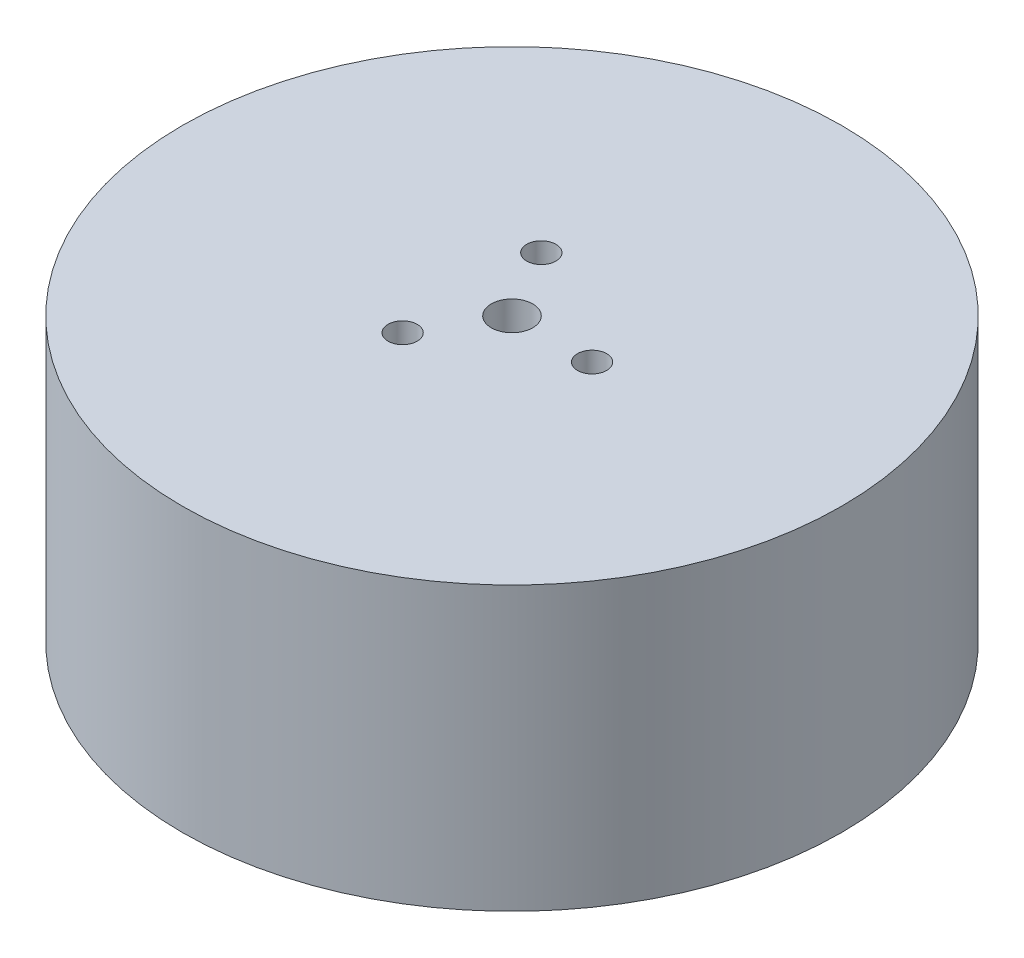
ISO-10303-21;
HEADER;
FILE_DESCRIPTION(('STEP AP214'),'2;1');
FILE_NAME('part.step','',(''),(''),'','','');
FILE_SCHEMA(('AUTOMOTIVE_DESIGN { 1 0 10303 214 1 1 1 1 }'));
ENDSEC;
DATA;
#1=APPLICATION_CONTEXT('core data for automotive mechanical design processes');
#2=APPLICATION_PROTOCOL_DEFINITION('international standard','automotive_design',2000,#1);
#3=PRODUCT_CONTEXT('',#1,'mechanical');
#4=PRODUCT('Part','Part','',(#3));
#5=PRODUCT_RELATED_PRODUCT_CATEGORY('part','',(#4));
#6=PRODUCT_DEFINITION_FORMATION('','',#4);
#7=PRODUCT_DEFINITION_CONTEXT('part definition',#1,'design');
#8=PRODUCT_DEFINITION('design','',#6,#7);
#9=PRODUCT_DEFINITION_SHAPE('','',#8);
#10=(LENGTH_UNIT() NAMED_UNIT(*) SI_UNIT(.MILLI.,.METRE.));
#11=(NAMED_UNIT(*) PLANE_ANGLE_UNIT() SI_UNIT($,.RADIAN.));
#12=(NAMED_UNIT(*) SI_UNIT($,.STERADIAN.) SOLID_ANGLE_UNIT());
#13=UNCERTAINTY_MEASURE_WITH_UNIT(LENGTH_MEASURE(1.E-05),#10,'distance_accuracy_value','');
#14=(GEOMETRIC_REPRESENTATION_CONTEXT(3) GLOBAL_UNCERTAINTY_ASSIGNED_CONTEXT((#13)) GLOBAL_UNIT_ASSIGNED_CONTEXT((#10,
#11,#12)) REPRESENTATION_CONTEXT('',''));
#15=CARTESIAN_POINT('',(0.,0.,0.));
#16=DIRECTION('',(0.,0.,1.));
#17=DIRECTION('',(1.,0.,0.));
#18=AXIS2_PLACEMENT_3D('',#15,#16,#17);
#19=CARTESIAN_POINT('',(0.,30.,0.));
#20=DIRECTION('',(0.,-1.,0.));
#21=DIRECTION('',(0.,0.,-1.));
#22=AXIS2_PLACEMENT_3D('',#19,#20,#21);
#23=CYLINDRICAL_SURFACE('',#22,35.);
#24=CARTESIAN_POINT('',(0.,30.,0.));
#25=DIRECTION('',(0.,1.,0.));
#26=DIRECTION('',(0.,0.,1.));
#27=AXIS2_PLACEMENT_3D('',#24,#25,#26);
#28=CIRCLE('',#27,35.);
#29=CARTESIAN_POINT('',(0.,30.,35.));
#30=VERTEX_POINT('',#29);
#31=EDGE_CURVE('E10',#30,#30,#28,.T.);
#32=ORIENTED_EDGE('',*,*,#31,.F.);
#33=EDGE_LOOP('',(#32));
#34=FACE_BOUND('',#33,.T.);
#35=CARTESIAN_POINT('',(0.,0.,0.));
#36=DIRECTION('',(0.,1.,0.));
#37=DIRECTION('',(0.,0.,1.));
#38=AXIS2_PLACEMENT_3D('',#35,#36,#37);
#39=CIRCLE('',#38,35.);
#40=CARTESIAN_POINT('',(0.,0.,35.));
#41=VERTEX_POINT('',#40);
#42=EDGE_CURVE('E39',#41,#41,#39,.T.);
#43=ORIENTED_EDGE('',*,*,#42,.T.);
#44=EDGE_LOOP('',(#43));
#45=FACE_BOUND('',#44,.T.);
#46=ADVANCED_FACE('F36',(#34,#45),#23,.T.);
#47=CARTESIAN_POINT('',(0.,30.,0.));
#48=DIRECTION('',(0.,1.,0.));
#49=DIRECTION('',(0.,0.,1.));
#50=AXIS2_PLACEMENT_3D('',#47,#48,#49);
#51=PLANE('',#50);
#52=CARTESIAN_POINT('',(-4.24999999999993,30.,-7.36121593216777));
#53=DIRECTION('',(0.,1.,0.));
#54=DIRECTION('',(0.,0.,1.));
#55=AXIS2_PLACEMENT_3D('',#52,#53,#54);
#56=CIRCLE('',#55,1.55);
#57=CARTESIAN_POINT('',(-4.24999999999993,30.,-5.81121593216777));
#58=VERTEX_POINT('',#57);
#59=EDGE_CURVE('E54',#58,#58,#56,.T.);
#60=ORIENTED_EDGE('',*,*,#59,.F.);
#61=EDGE_LOOP('',(#60));
#62=FACE_BOUND('',#61,.T.);
#63=CARTESIAN_POINT('',(-4.25000000000003,30.,7.36121593216771));
#64=DIRECTION('',(0.,1.,0.));
#65=DIRECTION('',(0.,0.,1.));
#66=AXIS2_PLACEMENT_3D('',#63,#64,#65);
#67=CIRCLE('',#66,1.55);
#68=CARTESIAN_POINT('',(-4.25000000000003,30.,8.91121593216771));
#69=VERTEX_POINT('',#68);
#70=EDGE_CURVE('E74',#69,#69,#67,.T.);
#71=ORIENTED_EDGE('',*,*,#70,.F.);
#72=EDGE_LOOP('',(#71));
#73=FACE_BOUND('',#72,.T.);
#74=CARTESIAN_POINT('',(0.,30.,0.));
#75=DIRECTION('',(0.,1.,0.));
#76=DIRECTION('',(0.,0.,1.));
#77=AXIS2_PLACEMENT_3D('',#74,#75,#76);
#78=CIRCLE('',#77,2.2);
#79=CARTESIAN_POINT('',(0.,30.,2.2));
#80=VERTEX_POINT('',#79);
#81=EDGE_CURVE('E66',#80,#80,#78,.T.);
#82=ORIENTED_EDGE('',*,*,#81,.F.);
#83=EDGE_LOOP('',(#82));
#84=FACE_BOUND('',#83,.T.);
#85=CARTESIAN_POINT('',(8.5,30.,0.));
#86=DIRECTION('',(0.,1.,0.));
#87=DIRECTION('',(0.,0.,1.));
#88=AXIS2_PLACEMENT_3D('',#85,#86,#87);
#89=CIRCLE('',#88,1.55);
#90=CARTESIAN_POINT('',(8.5,30.,1.55));
#91=VERTEX_POINT('',#90);
#92=EDGE_CURVE('E58',#91,#91,#89,.T.);
#93=ORIENTED_EDGE('',*,*,#92,.F.);
#94=EDGE_LOOP('',(#93));
#95=FACE_BOUND('',#94,.T.);
#96=ORIENTED_EDGE('',*,*,#31,.T.);
#97=EDGE_LOOP('',(#96));
#98=FACE_BOUND('',#97,.T.);
#99=ADVANCED_FACE('F92',(#62,#73,#84,#95,#98),#51,.T.);
#100=CARTESIAN_POINT('',(0.,0.,0.));
#101=DIRECTION('',(0.,1.,0.));
#102=DIRECTION('',(0.,0.,1.));
#103=AXIS2_PLACEMENT_3D('',#100,#101,#102);
#104=PLANE('',#103);
#105=CARTESIAN_POINT('',(0.,0.,0.));
#106=DIRECTION('',(0.,-1.,0.));
#107=DIRECTION('',(0.,0.,-1.));
#108=AXIS2_PLACEMENT_3D('',#105,#106,#107);
#109=CIRCLE('',#108,23.2);
#110=CARTESIAN_POINT('',(0.,0.,-23.2));
#111=VERTEX_POINT('',#110);
#112=EDGE_CURVE('E50',#111,#111,#109,.T.);
#113=ORIENTED_EDGE('',*,*,#112,.F.);
#114=EDGE_LOOP('',(#113));
#115=FACE_BOUND('',#114,.T.);
#116=ORIENTED_EDGE('',*,*,#42,.F.);
#117=EDGE_LOOP('',(#116));
#118=FACE_BOUND('',#117,.T.);
#119=ADVANCED_FACE('F95',(#115,#118),#104,.F.);
#120=CARTESIAN_POINT('',(0.,26.,0.));
#121=DIRECTION('',(0.,-1.,0.));
#122=DIRECTION('',(0.,0.,-1.));
#123=AXIS2_PLACEMENT_3D('',#120,#121,#122);
#124=CYLINDRICAL_SURFACE('',#123,23.2);
#125=CARTESIAN_POINT('',(0.,26.,0.));
#126=DIRECTION('',(0.,-1.,0.));
#127=DIRECTION('',(0.,0.,-1.));
#128=AXIS2_PLACEMENT_3D('',#125,#126,#127);
#129=CIRCLE('',#128,23.2);
#130=CARTESIAN_POINT('',(0.,26.,-23.2));
#131=VERTEX_POINT('',#130);
#132=EDGE_CURVE('E48',#131,#131,#129,.T.);
#133=ORIENTED_EDGE('',*,*,#132,.F.);
#134=EDGE_LOOP('',(#133));
#135=FACE_BOUND('',#134,.T.);
#136=ORIENTED_EDGE('',*,*,#112,.T.);
#137=EDGE_LOOP('',(#136));
#138=FACE_BOUND('',#137,.T.);
#139=ADVANCED_FACE('F117',(#135,#138),#124,.F.);
#140=CARTESIAN_POINT('',(0.,26.,0.));
#141=DIRECTION('',(0.,-1.,0.));
#142=DIRECTION('',(0.,0.,-1.));
#143=AXIS2_PLACEMENT_3D('',#140,#141,#142);
#144=PLANE('',#143);
#145=CARTESIAN_POINT('',(-4.24999999999993,26.,-7.36121593216777));
#146=DIRECTION('',(0.,-1.,0.));
#147=DIRECTION('',(0.,0.,-1.));
#148=AXIS2_PLACEMENT_3D('',#145,#146,#147);
#149=CIRCLE('',#148,1.55);
#150=CARTESIAN_POINT('',(-4.24999999999993,26.,-8.91121593216777));
#151=VERTEX_POINT('',#150);
#152=EDGE_CURVE('E82',#151,#151,#149,.F.);
#153=ORIENTED_EDGE('',*,*,#152,.T.);
#154=EDGE_LOOP('',(#153));
#155=FACE_BOUND('',#154,.T.);
#156=CARTESIAN_POINT('',(-4.25000000000003,26.,7.36121593216771));
#157=DIRECTION('',(0.,-1.,0.));
#158=DIRECTION('',(0.,0.,-1.));
#159=AXIS2_PLACEMENT_3D('',#156,#157,#158);
#160=CIRCLE('',#159,1.55);
#161=CARTESIAN_POINT('',(-4.25000000000003,26.,5.81121593216771));
#162=VERTEX_POINT('',#161);
#163=EDGE_CURVE('E78',#162,#162,#160,.F.);
#164=ORIENTED_EDGE('',*,*,#163,.T.);
#165=EDGE_LOOP('',(#164));
#166=FACE_BOUND('',#165,.T.);
#167=CARTESIAN_POINT('',(0.,26.,0.));
#168=DIRECTION('',(0.,-1.,0.));
#169=DIRECTION('',(0.,0.,-1.));
#170=AXIS2_PLACEMENT_3D('',#167,#168,#169);
#171=CIRCLE('',#170,2.2);
#172=CARTESIAN_POINT('',(0.,26.,-2.2));
#173=VERTEX_POINT('',#172);
#174=EDGE_CURVE('E70',#173,#173,#171,.F.);
#175=ORIENTED_EDGE('',*,*,#174,.T.);
#176=EDGE_LOOP('',(#175));
#177=FACE_BOUND('',#176,.T.);
#178=CARTESIAN_POINT('',(8.5,26.,0.));
#179=DIRECTION('',(0.,-1.,0.));
#180=DIRECTION('',(0.,0.,-1.));
#181=AXIS2_PLACEMENT_3D('',#178,#179,#180);
#182=CIRCLE('',#181,1.55);
#183=CARTESIAN_POINT('',(8.5,26.,-1.55));
#184=VERTEX_POINT('',#183);
#185=EDGE_CURVE('E62',#184,#184,#182,.F.);
#186=ORIENTED_EDGE('',*,*,#185,.T.);
#187=EDGE_LOOP('',(#186));
#188=FACE_BOUND('',#187,.T.);
#189=ORIENTED_EDGE('',*,*,#132,.T.);
#190=EDGE_LOOP('',(#189));
#191=FACE_BOUND('',#190,.T.);
#192=ADVANCED_FACE('F106',(#155,#166,#177,#188,#191),#144,.T.);
#193=CARTESIAN_POINT('',(8.5,-0.001000000000001,0.));
#194=DIRECTION('',(0.,1.,0.));
#195=DIRECTION('',(0.,0.,1.));
#196=AXIS2_PLACEMENT_3D('',#193,#194,#195);
#197=CYLINDRICAL_SURFACE('',#196,1.55);
#198=ORIENTED_EDGE('',*,*,#185,.F.);
#199=EDGE_LOOP('',(#198));
#200=FACE_BOUND('',#199,.T.);
#201=ORIENTED_EDGE('',*,*,#92,.T.);
#202=EDGE_LOOP('',(#201));
#203=FACE_BOUND('',#202,.T.);
#204=ADVANCED_FACE('F103',(#200,#203),#197,.F.);
#205=CARTESIAN_POINT('',(0.,-0.001000000000001,0.));
#206=DIRECTION('',(0.,1.,0.));
#207=DIRECTION('',(0.,0.,1.));
#208=AXIS2_PLACEMENT_3D('',#205,#206,#207);
#209=CYLINDRICAL_SURFACE('',#208,2.2);
#210=ORIENTED_EDGE('',*,*,#174,.F.);
#211=EDGE_LOOP('',(#210));
#212=FACE_BOUND('',#211,.T.);
#213=ORIENTED_EDGE('',*,*,#81,.T.);
#214=EDGE_LOOP('',(#213));
#215=FACE_BOUND('',#214,.T.);
#216=ADVANCED_FACE('F105',(#212,#215),#209,.F.);
#217=CARTESIAN_POINT('',(-4.25000000000003,-0.001000000000001,7.36121593216771));
#218=DIRECTION('',(0.,1.,0.));
#219=DIRECTION('',(0.,0.,1.));
#220=AXIS2_PLACEMENT_3D('',#217,#218,#219);
#221=CYLINDRICAL_SURFACE('',#220,1.55);
#222=ORIENTED_EDGE('',*,*,#163,.F.);
#223=EDGE_LOOP('',(#222));
#224=FACE_BOUND('',#223,.T.);
#225=ORIENTED_EDGE('',*,*,#70,.T.);
#226=EDGE_LOOP('',(#225));
#227=FACE_BOUND('',#226,.T.);
#228=ADVANCED_FACE('F113',(#224,#227),#221,.F.);
#229=CARTESIAN_POINT('',(-4.24999999999993,-0.001000000000001,-7.36121593216777));
#230=DIRECTION('',(0.,1.,0.));
#231=DIRECTION('',(0.,0.,1.));
#232=AXIS2_PLACEMENT_3D('',#229,#230,#231);
#233=CYLINDRICAL_SURFACE('',#232,1.55);
#234=ORIENTED_EDGE('',*,*,#152,.F.);
#235=EDGE_LOOP('',(#234));
#236=FACE_BOUND('',#235,.T.);
#237=ORIENTED_EDGE('',*,*,#59,.T.);
#238=EDGE_LOOP('',(#237));
#239=FACE_BOUND('',#238,.T.);
#240=ADVANCED_FACE('F90',(#236,#239),#233,.F.);
#241=CLOSED_SHELL('',(#46,#99,#119,#139,#192,#204,#216,#228,#240));
#242=MANIFOLD_SOLID_BREP('B2',#241);
#243=ADVANCED_BREP_SHAPE_REPRESENTATION('',(#18,#242),#14);
#244=SHAPE_DEFINITION_REPRESENTATION(#9,#243);
ENDSEC;
END-ISO-10303-21;
